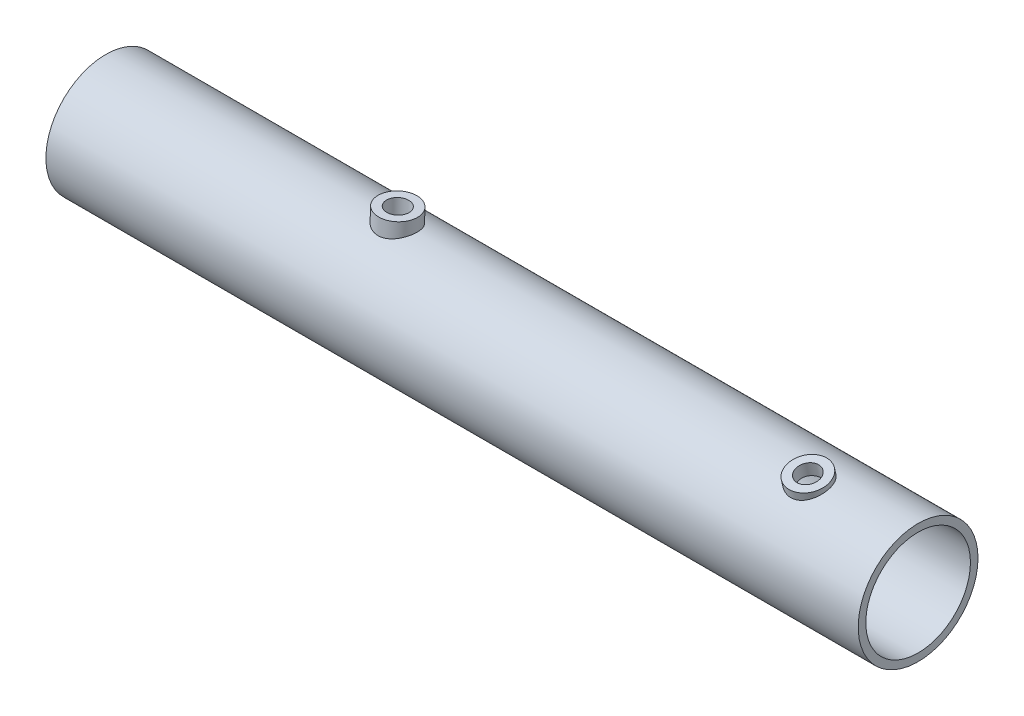
ISO-10303-21;
HEADER;
FILE_DESCRIPTION(('STEP AP214'),'2;1');
FILE_NAME('part.step','',(''),(''),'','','');
FILE_SCHEMA(('AUTOMOTIVE_DESIGN { 1 0 10303 214 1 1 1 1 }'));
ENDSEC;
DATA;
#1=APPLICATION_CONTEXT('core data for automotive mechanical design processes');
#2=APPLICATION_PROTOCOL_DEFINITION('international standard','automotive_design',2000,#1);
#3=PRODUCT_CONTEXT('',#1,'mechanical');
#4=PRODUCT('Part','Part','',(#3));
#5=PRODUCT_RELATED_PRODUCT_CATEGORY('part','',(#4));
#6=PRODUCT_DEFINITION_FORMATION('','',#4);
#7=PRODUCT_DEFINITION_CONTEXT('part definition',#1,'design');
#8=PRODUCT_DEFINITION('design','',#6,#7);
#9=PRODUCT_DEFINITION_SHAPE('','',#8);
#10=(LENGTH_UNIT() NAMED_UNIT(*) SI_UNIT(.MILLI.,.METRE.));
#11=(NAMED_UNIT(*) PLANE_ANGLE_UNIT() SI_UNIT($,.RADIAN.));
#12=(NAMED_UNIT(*) SI_UNIT($,.STERADIAN.) SOLID_ANGLE_UNIT());
#13=UNCERTAINTY_MEASURE_WITH_UNIT(LENGTH_MEASURE(1.E-05),#10,'distance_accuracy_value','');
#14=(GEOMETRIC_REPRESENTATION_CONTEXT(3) GLOBAL_UNCERTAINTY_ASSIGNED_CONTEXT((#13)) GLOBAL_UNIT_ASSIGNED_CONTEXT((#10,
#11,#12)) REPRESENTATION_CONTEXT('',''));
#15=CARTESIAN_POINT('',(0.,0.,0.));
#16=DIRECTION('',(0.,0.,1.));
#17=DIRECTION('',(1.,0.,0.));
#18=AXIS2_PLACEMENT_3D('',#15,#16,#17);
#19=CARTESIAN_POINT('',(295.,0.,0.));
#20=DIRECTION('',(-1.,0.,0.));
#21=DIRECTION('',(0.,0.,1.));
#22=AXIS2_PLACEMENT_3D('',#19,#20,#21);
#23=CYLINDRICAL_SURFACE('',#22,21.75);
#24=CARTESIAN_POINT('',(260.456376429784,18.3671321405636,11.6495045787826));
#25=CARTESIAN_POINT('',(260.646898102656,18.3671322417386,11.6495045007218));
#26=CARTESIAN_POINT('',(260.837421417738,18.3715626970911,11.6425279792126));
#27=CARTESIAN_POINT('',(261.217041275634,18.3891812990565,11.6146795241124));
#28=CARTESIAN_POINT('',(261.406137801234,18.4023695511696,11.5938074231295));
#29=CARTESIAN_POINT('',(261.781515058111,18.4372018067194,11.5383343317307));
#30=CARTESIAN_POINT('',(261.967795761762,18.458845893059,11.5037332067125));
#31=CARTESIAN_POINT('',(262.336289023577,18.5101185593613,11.4210496127633));
#32=CARTESIAN_POINT('',(262.518500030714,18.5397501290961,11.3729620955066));
#33=CARTESIAN_POINT('',(262.87711959476,18.6062822321463,11.263784134165));
#34=CARTESIAN_POINT('',(263.05354110399,18.6431650349375,11.2027253782472));
#35=CARTESIAN_POINT('',(263.399984059704,18.7235147451763,11.067910944351));
#36=CARTESIAN_POINT('',(263.570003093714,18.766984104073,10.994150537547));
#37=CARTESIAN_POINT('',(263.902523068557,18.8596627107682,10.8343961273323));
#38=CARTESIAN_POINT('',(264.065025642144,18.9088707037428,10.7484047974656));
#39=CARTESIAN_POINT('',(264.381639562437,19.0121510705117,10.5646453738589));
#40=CARTESIAN_POINT('',(264.53574763072,19.0662253232367,10.4668727262057));
#41=CARTESIAN_POINT('',(264.994705497099,19.2383436053802,10.1492809285233));
#42=CARTESIAN_POINT('',(265.284498725345,19.362951146295,9.91076902783006));
#43=CARTESIAN_POINT('',(265.817193347288,19.6207933919555,9.38994758260221));
#44=CARTESIAN_POINT('',(266.060086623045,19.7540295849195,9.1076304710237));
#45=CARTESIAN_POINT('',(266.387463593153,19.9559806708337,8.65160171178329));
#46=CARTESIAN_POINT('',(266.491618367903,20.0246286385753,8.49167365879143));
#47=CARTESIAN_POINT('',(266.68504944257,20.1609618094932,8.16270475630642));
#48=CARTESIAN_POINT('',(266.774331641192,20.2286473845811,7.99366755502538));
#49=CARTESIAN_POINT('',(266.937299999104,20.3620592692421,7.64744920143066));
#50=CARTESIAN_POINT('',(267.010982580518,20.4277851263774,7.47026619213941));
#51=CARTESIAN_POINT('',(267.14203678087,20.5562891341866,7.10902244017815));
#52=CARTESIAN_POINT('',(267.199415680647,20.6190685901636,6.92496480923295));
#53=CARTESIAN_POINT('',(267.295788115333,20.7389187532056,6.55713152126768));
#54=CARTESIAN_POINT('',(267.335306601108,20.7961073170407,6.37353172454558));
#55=CARTESIAN_POINT('',(267.398161180051,20.9062431420861,6.00241131812211));
#56=CARTESIAN_POINT('',(267.421503908972,20.9591921345945,5.81489234873673));
#57=CARTESIAN_POINT('',(267.451786011437,21.0603146866953,5.43726506663005));
#58=CARTESIAN_POINT('',(267.458725878233,21.1084883898441,5.24715683194374));
#59=CARTESIAN_POINT('',(267.456116137022,21.1996411705263,4.86581370608762));
#60=CARTESIAN_POINT('',(267.446566940301,21.2426203775968,4.67457884313778));
#61=CARTESIAN_POINT('',(267.411769610396,21.3215033189752,4.30013196804825));
#62=CARTESIAN_POINT('',(267.387164463296,21.3576212501996,4.11690490717022));
#63=CARTESIAN_POINT('',(267.323028891725,21.4247267490357,3.75206578003611));
#64=CARTESIAN_POINT('',(267.283493412799,21.4557125741284,3.5704542820415));
#65=CARTESIAN_POINT('',(267.189847446232,21.5125502700499,3.21028226877589));
#66=CARTESIAN_POINT('',(267.135741910704,21.5384038800534,3.03172073876127));
#67=CARTESIAN_POINT('',(267.013368442857,21.5851417264709,2.67877961845415));
#68=CARTESIAN_POINT('',(266.945095179497,21.6060240859303,2.50440162998132));
#69=CARTESIAN_POINT('',(266.794284097981,21.6432170238968,2.15962513541687));
#70=CARTESIAN_POINT('',(266.711628980722,21.6594868636175,1.98927357589332));
#71=CARTESIAN_POINT('',(266.533048124578,21.6875735747036,1.65522246113258));
#72=CARTESIAN_POINT('',(266.437117848047,21.6993889182906,1.49152520529413));
#73=CARTESIAN_POINT('',(266.232672789605,21.7189942911377,1.17193110052309));
#74=CARTESIAN_POINT('',(266.124157613075,21.7267841941323,1.01603449641129));
#75=CARTESIAN_POINT('',(265.895252211212,21.7388366271445,0.713071232884585));
#76=CARTESIAN_POINT('',(265.774861579487,21.7430990363998,0.566004875929366));
#77=CARTESIAN_POINT('',(265.517550594194,21.7487595813445,0.275583625796235));
#78=CARTESIAN_POINT('',(265.38014314423,21.7500272346696,0.132657406400566));
#79=CARTESIAN_POINT('',(265.094152514793,21.7499718786044,-0.141440651379987));
#80=CARTESIAN_POINT('',(264.945572863981,21.7486496839217,-0.272616172694221));
#81=CARTESIAN_POINT('',(264.63804922655,21.7440859989185,-0.522332149482237));
#82=CARTESIAN_POINT('',(264.479100038002,21.7408435385961,-0.640866183505778));
#83=CARTESIAN_POINT('',(264.151960690521,21.7331107033341,-0.86422602997955));
#84=CARTESIAN_POINT('',(263.983774114504,21.7286208095335,-0.969057104825561));
#85=CARTESIAN_POINT('',(263.636559678825,21.7189690382993,-1.16564165015239));
#86=CARTESIAN_POINT('',(263.457406259212,21.7137980185756,-1.25717316823259));
#87=CARTESIAN_POINT('',(263.091902280473,21.7034743779061,-1.42432970358908));
#88=CARTESIAN_POINT('',(262.905554493169,21.6983217506936,-1.49996077595809));
#89=CARTESIAN_POINT('',(262.526936811136,21.6885964805492,-1.63457689243846));
#90=CARTESIAN_POINT('',(262.33466741732,21.6840237887267,-1.69356334026665));
#91=CARTESIAN_POINT('',(261.945632380696,21.6759253047353,-1.79424608899837));
#92=CARTESIAN_POINT('',(261.748866931621,21.672399467549,-1.83594313342366));
#93=CARTESIAN_POINT('',(261.359916055582,21.6668479495967,-1.90031635775887));
#94=CARTESIAN_POINT('',(261.167840904155,21.6647703319852,-1.92365540572365));
#95=CARTESIAN_POINT('',(260.782382824914,21.6620884268045,-1.95362587281871));
#96=CARTESIAN_POINT('',(260.588999936067,21.6614840955276,-1.96025778759665));
#97=CARTESIAN_POINT('',(260.202416564243,21.661802278276,-1.95673822639168));
#98=CARTESIAN_POINT('',(260.009216059463,21.6627245778844,-1.94658910732283));
#99=CARTESIAN_POINT('',(259.624430933613,21.6660142259454,-1.90962583390135));
#100=CARTESIAN_POINT('',(259.432846295204,21.6683815588713,-1.88281185861212));
#101=CARTESIAN_POINT('',(259.058366599581,21.6742606601696,-1.81385784924365));
#102=CARTESIAN_POINT('',(258.875382478462,21.6777363402197,-1.77219678822769));
#103=CARTESIAN_POINT('',(258.513448113292,21.6855503902809,-1.67386820421271));
#104=CARTESIAN_POINT('',(258.334499235252,21.6898890476872,-1.61719567988977));
#105=CARTESIAN_POINT('',(257.981901391771,21.6990384528948,-1.48940541318085));
#106=CARTESIAN_POINT('',(257.808251195607,21.7038490899584,-1.41829105502331));
#107=CARTESIAN_POINT('',(257.467216553194,21.7134848220033,-1.26221560946074));
#108=CARTESIAN_POINT('',(257.299834509451,21.718309921778,-1.17724927822896));
#109=CARTESIAN_POINT('',(256.967952963388,21.7275829672978,-0.991712928215651));
#110=CARTESIAN_POINT('',(256.803654664059,21.7320171400696,-0.890782303319407));
#111=CARTESIAN_POINT('',(256.483723014876,21.7397621932911,-0.675870687250705));
#112=CARTESIAN_POINT('',(256.328092685981,21.7430726841378,-0.561885187976744));
#113=CARTESIAN_POINT('',(256.02646817283,21.7479513714782,-0.321758746412558));
#114=CARTESIAN_POINT('',(255.880474549265,21.749519466678,-0.195617097890059));
#115=CARTESIAN_POINT('',(255.598996651283,21.7502930429308,0.0679001002227277));
#116=CARTESIAN_POINT('',(255.463512561331,21.7494984825238,0.205275846909043));
#117=CARTESIAN_POINT('',(255.198626761549,21.7448477613791,0.496063898453863));
#118=CARTESIAN_POINT('',(255.069691676239,21.7408692502668,0.649899792805963));
#119=CARTESIAN_POINT('',(254.825008735324,21.7290514936775,0.967502606920927));
#120=CARTESIAN_POINT('',(254.709256399508,21.7212135646891,1.13126612357422));
#121=CARTESIAN_POINT('',(254.491684043367,21.7010818941056,1.46762923940858));
#122=CARTESIAN_POINT('',(254.389868952296,21.6887865816263,1.64023193528069));
#123=CARTESIAN_POINT('',(254.201046239746,21.6592310334569,1.99286162996713));
#124=CARTESIAN_POINT('',(254.114032434179,21.6419728794282,2.17288548891338));
#125=CARTESIAN_POINT('',(253.956179995472,21.6022505309158,2.53743767877672));
#126=CARTESIAN_POINT('',(253.885205453408,21.5798336011232,2.72191226898782));
#127=CARTESIAN_POINT('',(253.759099234069,21.5294355878397,3.09538177586982));
#128=CARTESIAN_POINT('',(253.703961194915,21.5014567463579,3.28437484422227));
#129=CARTESIAN_POINT('',(253.609995179789,21.4397817441468,3.66544795491474));
#130=CARTESIAN_POINT('',(253.571166130149,21.4060859599852,3.85752779317921));
#131=CARTESIAN_POINT('',(253.510178665868,21.3329779941875,4.24323836328338));
#132=CARTESIAN_POINT('',(253.488019639087,21.2935660225189,4.43686903791088));
#133=CARTESIAN_POINT('',(253.461158887721,21.210983093471,4.81588053796673));
#134=CARTESIAN_POINT('',(253.455755371941,21.1680430263552,5.00126229950579));
#135=CARTESIAN_POINT('',(253.460452128356,21.0773370970595,5.37071235486291));
#136=CARTESIAN_POINT('',(253.470557689396,21.0295695938361,5.55478017909983));
#137=CARTESIAN_POINT('',(253.506165115584,20.9296539671317,5.92012976261077));
#138=CARTESIAN_POINT('',(253.531660385611,20.8775077283544,6.10141268122528));
#139=CARTESIAN_POINT('',(253.597804173579,20.7693274223144,6.46008093792177));
#140=CARTESIAN_POINT('',(253.638458367481,20.7132919051919,6.63746478969666));
#141=CARTESIAN_POINT('',(253.734039290517,20.5985974050972,6.98522972404015));
#142=CARTESIAN_POINT('',(253.788808405395,20.5399729702303,7.15566547910765));
#143=CARTESIAN_POINT('',(253.91235670334,20.4202461910246,7.49050966368584));
#144=CARTESIAN_POINT('',(253.98114098628,20.3591429511929,7.65491587338092));
#145=CARTESIAN_POINT('',(254.207707505405,20.1732813115385,8.13754642833287));
#146=CARTESIAN_POINT('',(254.385784312584,20.0458734058893,8.44547440777313));
#147=CARTESIAN_POINT('',(254.798741192857,19.7859987242758,9.03800706064655));
#148=CARTESIAN_POINT('',(255.035519017485,19.6535233013893,9.32128471653404));
#149=CARTESIAN_POINT('',(255.425474688215,19.4607108342185,9.71414740362359));
#150=CARTESIAN_POINT('',(255.561359474926,19.3973835289661,9.83983183116818));
#151=CARTESIAN_POINT('',(255.843958969838,19.2736966802644,10.0799461665451));
#152=CARTESIAN_POINT('',(255.990669815965,19.2133360911528,10.1943800542272));
#153=CARTESIAN_POINT('',(256.299516921875,19.0944971458704,10.4153247817997));
#154=CARTESIAN_POINT('',(256.462017809931,19.0361640768606,10.5214039041228));
#155=CARTESIAN_POINT('',(256.796645788223,18.9248963196898,10.7202507765377));
#156=CARTESIAN_POINT('',(256.96876941245,18.8719597069329,10.8130232771507));
#157=CARTESIAN_POINT('',(257.32155669818,18.7725399026555,10.9847208525162));
#158=CARTESIAN_POINT('',(257.502219461569,18.7260560344746,11.0636473794417));
#159=CARTESIAN_POINT('',(257.870859530844,18.6405407379539,11.2071282165658));
#160=CARTESIAN_POINT('',(258.058836102085,18.6015085634325,11.2716839659019));
#161=CARTESIAN_POINT('',(258.426716390816,18.5343466240096,11.3817547083484));
#162=CARTESIAN_POINT('',(258.606198790358,18.5056266112277,11.4283200482353));
#163=CARTESIAN_POINT('',(258.969100414851,18.4559386328033,11.5083905860708));
#164=CARTESIAN_POINT('',(259.152519324634,18.434970048991,11.5418968254829));
#165=CARTESIAN_POINT('',(259.522029998594,18.4012348994778,11.5956053083698));
#166=CARTESIAN_POINT('',(259.708121579366,18.3884677736935,11.6158084603244));
#167=CARTESIAN_POINT('',(260.081600694967,18.3714177848928,11.6427558489349));
#168=CARTESIAN_POINT('',(260.268987768054,18.3671320410523,11.6495046555597));
#169=CARTESIAN_POINT('',(260.456376429784,18.3671321405636,11.6495045787826));
#170=B_SPLINE_CURVE_WITH_KNOTS('',3,(#24,#25,#26,#27,#28,#29,#30,#31,#32,#33,#34,#35,#36,#37,
#38,#39,#40,#41,#42,#43,#44,#45,#46,#47,#48,#49,#50,#51,#52,#53,#54,#55,#56,#57,#58,#59,#60,#61,
#62,#63,#64,#65,#66,#67,#68,#69,#70,#71,#72,#73,#74,#75,#76,#77,#78,#79,#80,#81,#82,#83,#84,#85,
#86,#87,#88,#89,#90,#91,#92,#93,#94,#95,#96,#97,#98,#99,#100,#101,#102,#103,#104,#105,#106,#107,
#108,#109,#110,#111,#112,#113,#114,#115,#116,#117,#118,#119,#120,#121,#122,#123,#124,#125,#126,
#127,#128,#129,#130,#131,#132,#133,#134,#135,#136,#137,#138,#139,#140,#141,#142,#143,#144,#145,
#146,#147,#148,#149,#150,#151,#152,#153,#154,#155,#156,#157,#158,#159,#160,#161,#162,#163,#164,
#165,#166,#167,#168,#169),.UNSPECIFIED.,.T.,.F.,(4,2,2,2,2,2,2,2,2,2,2,2,2,2,2,2,2,2,2,2,2,2,2,
2,2,2,2,2,2,2,2,2,2,2,2,2,2,2,2,2,2,2,2,2,2,2,2,2,2,2,2,2,2,2,2,2,2,2,2,2,2,2,2,2,2,2,2,2,2,2,2,
2,4),(0.,0.571389678197333,1.1427862397185,1.71418840347069,2.28580474483246,2.85604038907651,
3.42648879290671,3.99681269413055,4.56735775800894,5.74810516762801,6.92905677064886,
7.53689538761278,8.14449234886982,8.75222851591014,9.35969285427679,9.94790904642436,
10.535883792609,11.1238408575162,11.7117832572702,12.2762168926292,12.840841780654,
13.4052750040702,13.9699209991468,14.5394088647516,15.1090918728322,15.6787927490201,
16.2485131278747,16.8426322534677,17.4365645126335,18.0307970466621,18.6248007007869,
19.2277949434523,19.8305591406023,20.4332724887052,21.0359599147464,21.6157343544472,
22.1954915938768,22.7751674127015,23.3548370030337,23.9172857203349,24.4799220631915,
25.0424267124329,25.6051448009862,26.18312003595,26.7612954621922,27.3395044987976,
27.9177236819375,28.519294928171,29.1206611140338,29.722239441505,30.3235658043978,
30.9195879383065,31.5153703008351,32.1111134351518,32.706834692109,33.2772423630863,
33.8478445954706,34.4182024748613,34.9887741283678,35.5532314856047,36.1178946069373,
37.2462781005066,38.4174455448929,39.003805403815,39.5899570874067,40.197144229145,
40.8041140600217,41.4110201934745,42.01786552196,42.5801332857373,43.1423561994731,
43.7045407145157,44.2665342426498),.UNSPECIFIED.);
#171=CARTESIAN_POINT('',(260.456376429784,18.3671321405636,11.6495045787826));
#172=VERTEX_POINT('',#171);
#173=EDGE_CURVE('E43',#172,#172,#170,.T.);
#174=ORIENTED_EDGE('',*,*,#173,.F.);
#175=EDGE_LOOP('',(#174));
#176=FACE_BOUND('',#175,.T.);
#177=CARTESIAN_POINT('',(295.,0.,0.));
#178=DIRECTION('',(1.,0.,0.));
#179=DIRECTION('',(0.,0.,-1.));
#180=AXIS2_PLACEMENT_3D('',#177,#178,#179);
#181=CIRCLE('',#180,21.75);
#182=CARTESIAN_POINT('',(295.,0.,-21.75));
#183=VERTEX_POINT('',#182);
#184=EDGE_CURVE('E47',#183,#183,#181,.T.);
#185=ORIENTED_EDGE('',*,*,#184,.F.);
#186=EDGE_LOOP('',(#185));
#187=FACE_BOUND('',#186,.T.);
#188=CARTESIAN_POINT('',(0.,0.,0.));
#189=DIRECTION('',(1.,0.,0.));
#190=DIRECTION('',(0.,0.,-1.));
#191=AXIS2_PLACEMENT_3D('',#188,#189,#190);
#192=CIRCLE('',#191,21.75);
#193=CARTESIAN_POINT('',(0.,0.,-21.75));
#194=VERTEX_POINT('',#193);
#195=EDGE_CURVE('E51',#194,#194,#192,.T.);
#196=ORIENTED_EDGE('',*,*,#195,.T.);
#197=EDGE_LOOP('',(#196));
#198=FACE_BOUND('',#197,.T.);
#199=CARTESIAN_POINT('',(105.42644355876,20.7342913544785,6.56899246670265));
#200=CARTESIAN_POINT('',(105.61761622317,20.7342914649437,6.56899231964091));
#201=CARTESIAN_POINT('',(105.808791134861,20.7368002374002,6.5610892040586));
#202=CARTESIAN_POINT('',(106.189710828106,20.7467478425617,6.52956542817701));
#203=CARTESIAN_POINT('',(106.379455584877,20.7541867605066,6.50594449612399));
#204=CARTESIAN_POINT('',(106.756125793255,20.7737436123354,6.44322532082809));
#205=CARTESIAN_POINT('',(106.943051183493,20.7858616479181,6.40412674118373));
#206=CARTESIAN_POINT('',(107.312822300558,20.8143823689515,6.31081320129046));
#207=CARTESIAN_POINT('',(107.495666471318,20.8307866593475,6.25659257822988));
#208=CARTESIAN_POINT('',(107.855551616769,20.8673123397854,6.13366730177155));
#209=CARTESIAN_POINT('',(108.032605355263,20.8874247995185,6.06499739133372));
#210=CARTESIAN_POINT('',(108.38026160528,20.9307725160008,5.91366585936169));
#211=CARTESIAN_POINT('',(108.55086165464,20.9540089494915,5.83099896237015));
#212=CARTESIAN_POINT('',(109.051280539083,21.0273704998056,5.56296613661674));
#213=CARTESIAN_POINT('',(109.370023813059,21.0811807512872,5.35746292344752));
#214=CARTESIAN_POINT('',(109.980467860493,21.1944809222411,4.89038937479742));
#215=CARTESIAN_POINT('',(110.270842971192,21.2541032716554,4.62711798723189));
#216=CARTESIAN_POINT('',(110.670854487131,21.3413342741562,4.19896183071144));
#217=CARTESIAN_POINT('',(110.798332075107,21.3700607142372,4.05060286810402));
#218=CARTESIAN_POINT('',(111.040652577443,21.4259609794756,3.74365958716139));
#219=CARTESIAN_POINT('',(111.155500230249,21.453135385067,3.5850791393415));
#220=CARTESIAN_POINT('',(111.374472347296,21.5057862315671,3.25458976198307));
#221=CARTESIAN_POINT('',(111.478258241249,21.5312034786493,3.08244715714844));
#222=CARTESIAN_POINT('',(111.670893931814,21.5787676958475,2.72964242799672));
#223=CARTESIAN_POINT('',(111.759749276262,21.6009158802954,2.54898350023683));
#224=CARTESIAN_POINT('',(111.921813560263,21.6412329261512,2.18034696452618));
#225=CARTESIAN_POINT('',(111.995022621971,21.6594018186264,1.99236941372741));
#226=CARTESIAN_POINT('',(112.125122170156,21.6911406541621,1.61047214758083));
#227=CARTESIAN_POINT('',(112.182013342325,21.7047107904705,1.41655268229644));
#228=CARTESIAN_POINT('',(112.277249342859,21.7263771701451,1.03102658883643));
#229=CARTESIAN_POINT('',(112.316166172426,21.7346460697053,0.839570879810655));
#230=CARTESIAN_POINT('',(112.377893408564,21.7461180558689,0.453932524506414));
#231=CARTESIAN_POINT('',(112.400704452038,21.7493213427983,0.259749986370263));
#232=CARTESIAN_POINT('',(112.429987419854,21.7504846090225,-0.12981862036816));
#233=CARTESIAN_POINT('',(112.436462774807,21.7484456894003,-0.325204427633797));
#234=CARTESIAN_POINT('',(112.433013264391,21.7390986424883,-0.715702860345628));
#235=CARTESIAN_POINT('',(112.423088775319,21.7317906361009,-0.91081549195708));
#236=CARTESIAN_POINT('',(112.387641006381,21.7124154554608,-1.29168620927507));
#237=CARTESIAN_POINT('',(112.362740370034,21.7005447423969,-1.47751264363137));
#238=CARTESIAN_POINT('',(112.298093687158,21.6722855485276,-1.84627925093861));
#239=CARTESIAN_POINT('',(112.258342707113,21.6558955668253,-2.02921844362899));
#240=CARTESIAN_POINT('',(112.164357743637,21.6189595563349,-2.39083971057021));
#241=CARTESIAN_POINT('',(112.110128479066,21.5984148822003,-2.56952315125356));
#242=CARTESIAN_POINT('',(111.987609389843,21.5536143256011,-2.92159470004741));
#243=CARTESIAN_POINT('',(111.919314264004,21.5293570448051,-3.09498078329797));
#244=CARTESIAN_POINT('',(111.768331561509,21.4773781157194,-3.43730327074111));
#245=CARTESIAN_POINT('',(111.685484722792,21.4496192052589,-3.60616373298758));
#246=CARTESIAN_POINT('',(111.506552166455,21.3914936908516,-3.93631900349587));
#247=CARTESIAN_POINT('',(111.410461917622,21.361126195727,-4.09761119685805));
#248=CARTESIAN_POINT('',(111.20573146209,21.2984875484485,-4.41163995761499));
#249=CARTESIAN_POINT('',(111.09709069557,21.266216311409,-4.56437614291383));
#250=CARTESIAN_POINT('',(110.86797011288,21.2005120974818,-4.86043039343062));
#251=CARTESIAN_POINT('',(110.747489875026,21.1670790792428,-5.0037481228904));
#252=CARTESIAN_POINT('',(110.489687464432,21.0982910648142,-5.28646706846969));
#253=CARTESIAN_POINT('',(110.351848182984,21.0629178762801,-5.4253927302117));
#254=CARTESIAN_POINT('',(110.064967123188,20.9926606492623,-5.69118564994214));
#255=CARTESIAN_POINT('',(109.915928866655,20.9577764610602,-5.81805667064707));
#256=CARTESIAN_POINT('',(109.607457193639,20.8893762413824,-6.05905622384778));
#257=CARTESIAN_POINT('',(109.448018444608,20.8558609263053,-6.17317813697307));
#258=CARTESIAN_POINT('',(109.119868680845,20.7911292261005,-6.38780157186658));
#259=CARTESIAN_POINT('',(108.951161283128,20.7599119551523,-6.48830835450457));
#260=CARTESIAN_POINT('',(108.602836842412,20.7001746271314,-6.67646369097894));
#261=CARTESIAN_POINT('',(108.423092446402,20.6717030994427,-6.76389218538646));
#262=CARTESIAN_POINT('',(108.056370822652,20.6188655850897,-6.92328932541984));
#263=CARTESIAN_POINT('',(107.869396407719,20.5944980211677,-6.9952639133115));
#264=CARTESIAN_POINT('',(107.489498198454,20.5506121270152,-7.12316060547992));
#265=CARTESIAN_POINT('',(107.296575028947,20.5310932894377,-7.1790843893296));
#266=CARTESIAN_POINT('',(106.906212801523,20.4975312417467,-7.27435703760065));
#267=CARTESIAN_POINT('',(106.708773955138,20.4834877756987,-7.31370667675197));
#268=CARTESIAN_POINT('',(106.319096906722,20.4617970958955,-7.37416753054218));
#269=CARTESIAN_POINT('',(106.126977600706,20.4539111342226,-7.39596068480141));
#270=CARTESIAN_POINT('',(105.741452148633,20.4438510847573,-7.42372370783662));
#271=CARTESIAN_POINT('',(105.548046045382,20.4416768079023,-7.42969410036197));
#272=CARTESIAN_POINT('',(105.161448553451,20.4431116069971,-7.42574518190556));
#273=CARTESIAN_POINT('',(104.968257136233,20.4467197901995,-7.41582832373815));
#274=CARTESIAN_POINT('',(104.583530174342,20.4596078878987,-7.38019667947714));
#275=CARTESIAN_POINT('',(104.391994609024,20.4688877315786,-7.35448209063526));
#276=CARTESIAN_POINT('',(104.018234863805,20.4924409703972,-7.28858974401313));
#277=CARTESIAN_POINT('',(103.835911097352,20.5065409993146,-7.24891287286247));
#278=CARTESIAN_POINT('',(103.475322039694,20.5393864141895,-7.15531715755702));
#279=CARTESIAN_POINT('',(103.297058118775,20.5581333439308,-7.10139357999758));
#280=CARTESIAN_POINT('',(102.94584878327,20.5997491252352,-6.97975376873141));
#281=CARTESIAN_POINT('',(102.772902118335,20.6226169989473,-6.91204080658731));
#282=CARTESIAN_POINT('',(102.433284367832,20.6718776992514,-6.76329127792212));
#283=CARTESIAN_POINT('',(102.266615690223,20.698271861073,-6.68224966180502));
#284=CARTESIAN_POINT('',(101.936170598964,20.7546563060406,-6.50504545079798));
#285=CARTESIAN_POINT('',(101.772595728979,20.784724797745,-6.40853191223721));
#286=CARTESIAN_POINT('',(101.454096050278,20.8470820437405,-6.20267973115886));
#287=CARTESIAN_POINT('',(101.299174253839,20.8793715625864,-6.09333666303713));
#288=CARTESIAN_POINT('',(100.998934067094,20.9453464417816,-5.86253904155953));
#289=CARTESIAN_POINT('',(100.853616282319,20.9790318899265,-5.74108372573761));
#290=CARTESIAN_POINT('',(100.573439200551,21.0469677804168,-5.48679905378874));
#291=CARTESIAN_POINT('',(100.438580118835,21.0812182343744,-5.35396946365689));
#292=CARTESIAN_POINT('',(100.174550785555,21.1509296486664,-5.07175459709356));
#293=CARTESIAN_POINT('',(100.045875751006,21.1863792068337,-4.92190265995209));
#294=CARTESIAN_POINT('',(99.8016838937065,21.2560671744943,-4.61165623351523));
#295=CARTESIAN_POINT('',(99.6861626607064,21.2903059872601,-4.45126530638162));
#296=CARTESIAN_POINT('',(99.4690073021004,21.3567209908802,-4.12084586539018));
#297=CARTESIAN_POINT('',(99.3673783251355,21.3888964146846,-3.95081381126397));
#298=CARTESIAN_POINT('',(99.1788713398998,21.4503353822881,-3.6023457300248));
#299=CARTESIAN_POINT('',(99.0919872255905,21.4796001293477,-3.42391322094522));
#300=CARTESIAN_POINT('',(98.9340991004518,21.5343225574666,-3.06087330904641));
#301=CARTESIAN_POINT('',(98.8630038187707,21.559801821941,-2.8763088856536));
#302=CARTESIAN_POINT('',(98.7366792300995,21.6065094875409,-2.50138280720846));
#303=CARTESIAN_POINT('',(98.681443586356,21.6277395854003,-2.31102350123292));
#304=CARTESIAN_POINT('',(98.5873087387711,21.6654338588504,-1.9258542597688));
#305=CARTESIAN_POINT('',(98.5484085256023,21.6818983288783,-1.73104460004143));
#306=CARTESIAN_POINT('',(98.4873125639382,21.7096691499526,-1.33846215685381));
#307=CARTESIAN_POINT('',(98.4651161934391,21.7209756930596,-1.14068948400752));
#308=CARTESIAN_POINT('',(98.4382183927656,21.7378266158282,-0.752078543455645));
#309=CARTESIAN_POINT('',(98.4328216711763,21.7435929564113,-0.561297690258433));
#310=CARTESIAN_POINT('',(98.4375999987409,21.7500940169573,-0.179778193360682));
#311=CARTESIAN_POINT('',(98.4477803690577,21.7508270170525,0.0109604136452912));
#312=CARTESIAN_POINT('',(98.4836165209002,21.7473172172215,0.390845739138539));
#313=CARTESIAN_POINT('',(98.5092655362014,21.7430765920699,0.579993116996348));
#314=CARTESIAN_POINT('',(98.5758063475601,21.7298150424645,0.955484965826434));
#315=CARTESIAN_POINT('',(98.6167038421637,21.7207923303532,1.14182836179638));
#316=CARTESIAN_POINT('',(98.7127654620478,21.6984259100945,1.50798169630958));
#317=CARTESIAN_POINT('',(98.7677402217285,21.6851390044587,1.68784473859988));
#318=CARTESIAN_POINT('',(98.8917427198156,21.6546314083193,2.04234300729451));
#319=CARTESIAN_POINT('',(98.9607755726684,21.6374092858735,2.21697630447769));
#320=CARTESIAN_POINT('',(99.1881611359994,21.5805802945052,2.73122282440074));
#321=CARTESIAN_POINT('',(99.3668835793201,21.5357903354245,3.06149568396676));
#322=CARTESIAN_POINT('',(99.7807696430164,21.4355696440862,3.69959599747352));
#323=CARTESIAN_POINT('',(100.017688666384,21.3798215409583,4.00623442188274));
#324=CARTESIAN_POINT('',(100.407795768882,21.2938186369588,4.43362718657612));
#325=CARTESIAN_POINT('',(100.543719910153,21.2647343961821,4.5707430114169));
#326=CARTESIAN_POINT('',(100.826372903824,21.2065933228847,4.83331578286636));
#327=CARTESIAN_POINT('',(100.973097896373,21.177536484295,4.95877685857135));
#328=CARTESIAN_POINT('',(101.28167253397,21.1193031513153,5.20131051668615));
#329=CARTESIAN_POINT('',(101.443867420581,21.0901564021895,5.31795081883164));
#330=CARTESIAN_POINT('',(101.777808252155,21.0337021672598,5.53702680546858));
#331=CARTESIAN_POINT('',(101.949550766289,21.0063940284727,5.63946754677071));
#332=CARTESIAN_POINT('',(102.30149712122,20.954488320306,5.8293751372452));
#333=CARTESIAN_POINT('',(102.481700080953,20.9298904695678,5.91684354123797));
#334=CARTESIAN_POINT('',(102.84934129993,20.884223144804,6.0760669747898));
#335=CARTESIAN_POINT('',(103.036778847188,20.8631533246547,6.14782354599932));
#336=CARTESIAN_POINT('',(103.403568105123,20.8266554992512,6.27030288371707));
#337=CARTESIAN_POINT('',(103.582504368926,20.8109270157266,6.32218246071974));
#338=CARTESIAN_POINT('',(103.944259143557,20.7835995491138,6.41144859475932));
#339=CARTESIAN_POINT('',(104.127077358188,20.7720002521569,6.44883625337846));
#340=CARTESIAN_POINT('',(104.495349549747,20.7532928726578,6.50878817774275));
#341=CARTESIAN_POINT('',(104.680803409023,20.7461845902813,6.53135310304901));
#342=CARTESIAN_POINT('',(105.052985612492,20.7366845589717,6.56145282821879));
#343=CARTESIAN_POINT('',(105.239713513603,20.7342912465805,6.56899261034686));
#344=CARTESIAN_POINT('',(105.42644355876,20.7342913544785,6.56899246670265));
#345=B_SPLINE_CURVE_WITH_KNOTS('',3,(#199,#200,#201,#202,#203,#204,#205,#206,#207,#208,#209,
#210,#211,#212,#213,#214,#215,#216,#217,#218,#219,#220,#221,#222,#223,#224,#225,#226,#227,#228,
#229,#230,#231,#232,#233,#234,#235,#236,#237,#238,#239,#240,#241,#242,#243,#244,#245,#246,#247,
#248,#249,#250,#251,#252,#253,#254,#255,#256,#257,#258,#259,#260,#261,#262,#263,#264,#265,#266,
#267,#268,#269,#270,#271,#272,#273,#274,#275,#276,#277,#278,#279,#280,#281,#282,#283,#284,#285,
#286,#287,#288,#289,#290,#291,#292,#293,#294,#295,#296,#297,#298,#299,#300,#301,#302,#303,#304,
#305,#306,#307,#308,#309,#310,#311,#312,#313,#314,#315,#316,#317,#318,#319,#320,#321,#322,#323,
#324,#325,#326,#327,#328,#329,#330,#331,#332,#333,#334,#335,#336,#337,#338,#339,#340,#341,#342,
#343,#344),.UNSPECIFIED.,.T.,.F.,(4,2,2,2,2,2,2,2,2,2,2,2,2,2,2,2,2,2,2,2,2,2,2,2,2,2,2,2,2,2,2,
2,2,2,2,2,2,2,2,2,2,2,2,2,2,2,2,2,2,2,2,2,2,2,2,2,2,2,2,2,2,2,2,2,2,2,2,2,2,2,2,2,4),(0.,
0.573343248068709,1.14669640923369,1.72006203272171,2.2936426556699,2.8658595636313,
3.43829262190539,4.58219561381935,5.76587326135187,6.35842153759872,6.95074674013156,
7.55783366995935,8.1646945195549,8.77155063105249,9.37838123820382,9.96428170686714,
10.5501590047768,11.1359132539621,11.7216540630915,12.2845797614207,12.8476926389703,
13.4106222065499,13.9737643223759,14.5435048545864,15.1134408088428,15.6834021951562,
16.2533838889921,16.8493215725768,17.44507262579,18.041131570903,18.6369595385831,
19.2418962282428,19.8465998921785,20.4512402562012,21.0558523542108,21.6356628313744,
22.2154541159866,22.795155895915,23.3748504377874,23.9355730032642,24.4964821011021,
25.057258276705,25.6182473953207,26.1944750457516,26.7709020561527,27.3473653755694,
27.923840557515,28.525145596338,29.126248430199,29.7275734396496,30.3286488217558,
30.9261534670788,31.5234190448289,32.12064771353,32.7178541420244,33.2899909550307,
33.8623232546516,34.434405388669,35.0067015315277,35.5716703373929,36.1368450517847,
37.2662329888077,38.4351211446499,39.0203316801368,39.6053340875412,40.2102969945398,
40.815043902882,41.4197279724029,42.0243526834996,42.5846254536448,43.1448556271098,
43.7050608705524,44.2650803217241),.UNSPECIFIED.);
#346=CARTESIAN_POINT('',(105.42644355876,20.7342913544785,6.56899246670265));
#347=VERTEX_POINT('',#346);
#348=EDGE_CURVE('E10',#347,#347,#345,.T.);
#349=ORIENTED_EDGE('',*,*,#348,.F.);
#350=EDGE_LOOP('',(#349));
#351=FACE_BOUND('',#350,.T.);
#352=ADVANCED_FACE('F32',(#176,#187,#198,#351),#23,.T.);
#353=CARTESIAN_POINT('',(295.,0.,0.));
#354=DIRECTION('',(1.,0.,0.));
#355=DIRECTION('',(0.,0.,-1.));
#356=AXIS2_PLACEMENT_3D('',#353,#354,#355);
#357=PLANE('',#356);
#358=ORIENTED_EDGE('',*,*,#184,.T.);
#359=EDGE_LOOP('',(#358));
#360=FACE_BOUND('',#359,.T.);
#361=CARTESIAN_POINT('',(295.,0.,0.));
#362=DIRECTION('',(1.,0.,0.));
#363=DIRECTION('',(0.,0.,-1.));
#364=AXIS2_PLACEMENT_3D('',#361,#362,#363);
#365=CIRCLE('',#364,19.);
#366=CARTESIAN_POINT('',(295.,0.,-19.));
#367=VERTEX_POINT('',#366);
#368=EDGE_CURVE('E122',#367,#367,#365,.T.);
#369=ORIENTED_EDGE('',*,*,#368,.F.);
#370=EDGE_LOOP('',(#369));
#371=FACE_BOUND('',#370,.T.);
#372=ADVANCED_FACE('F77',(#360,#371),#357,.T.);
#373=CARTESIAN_POINT('',(0.,0.,0.));
#374=DIRECTION('',(1.,0.,0.));
#375=DIRECTION('',(0.,0.,-1.));
#376=AXIS2_PLACEMENT_3D('',#373,#374,#375);
#377=PLANE('',#376);
#378=ORIENTED_EDGE('',*,*,#195,.F.);
#379=EDGE_LOOP('',(#378));
#380=FACE_BOUND('',#379,.T.);
#381=CARTESIAN_POINT('',(0.,0.,0.));
#382=DIRECTION('',(1.,0.,0.));
#383=DIRECTION('',(0.,0.,-1.));
#384=AXIS2_PLACEMENT_3D('',#381,#382,#383);
#385=CIRCLE('',#384,19.);
#386=CARTESIAN_POINT('',(0.,0.,-19.));
#387=VERTEX_POINT('',#386);
#388=EDGE_CURVE('E124',#387,#387,#385,.T.);
#389=ORIENTED_EDGE('',*,*,#388,.T.);
#390=EDGE_LOOP('',(#389));
#391=FACE_BOUND('',#390,.T.);
#392=ADVANCED_FACE('F75',(#380,#391),#377,.F.);
#393=CARTESIAN_POINT('',(295.,0.,0.));
#394=DIRECTION('',(-1.,0.,0.));
#395=DIRECTION('',(0.,0.,1.));
#396=AXIS2_PLACEMENT_3D('',#393,#394,#395);
#397=CYLINDRICAL_SURFACE('',#396,19.);
#398=CARTESIAN_POINT('',(105.41224964478,18.6518921163836,3.62034811569111));
#399=CARTESIAN_POINT('',(105.19060275322,18.6518963751163,3.62034017610146));
#400=CARTESIAN_POINT('',(104.968860254863,18.6555283946794,3.60176637563214));
#401=CARTESIAN_POINT('',(104.531666922402,18.6696128162529,3.52801857953967));
#402=CARTESIAN_POINT('',(104.316220870493,18.6800702684403,3.47281748266581));
#403=CARTESIAN_POINT('',(103.898007768727,18.7064769087578,3.32763031501209));
#404=CARTESIAN_POINT('',(103.695227830519,18.7224204033725,3.23768029547191));
#405=CARTESIAN_POINT('',(103.307580462627,18.7578435186748,3.02569070943351));
#406=CARTESIAN_POINT('',(103.122712467595,18.7773230277005,2.90365215618652));
#407=CARTESIAN_POINT('',(102.773225292337,18.8177575580084,2.6289709130444));
#408=CARTESIAN_POINT('',(102.608926821479,18.8387294547212,2.47592262471257));
#409=CARTESIAN_POINT('',(102.308015577708,18.8793254647274,2.14450301639505));
#410=CARTESIAN_POINT('',(102.171405032105,18.8989494695079,1.96612966113667));
#411=CARTESIAN_POINT('',(101.928272615483,18.9345946562956,1.58674833433694));
#412=CARTESIAN_POINT('',(101.822102579732,18.9505733048236,1.38551052152845));
#413=CARTESIAN_POINT('',(101.645080961913,18.9764940375609,0.967692153061702));
#414=CARTESIAN_POINT('',(101.574226112816,18.9864366801834,0.751113018756313));
#415=CARTESIAN_POINT('',(101.470759342726,18.9986957038117,0.311772965417624));
#416=CARTESIAN_POINT('',(101.43766088017,19.00110982078,0.0891294524836749));
#417=CARTESIAN_POINT('',(101.409143607661,18.9979354858819,-0.358491267647102));
#418=CARTESIAN_POINT('',(101.413720850594,18.9923478723713,-0.583468227912835));
#419=CARTESIAN_POINT('',(101.460045127636,18.9735672156234,-1.02566278904921));
#420=CARTESIAN_POINT('',(101.501211510728,18.9604941119131,-1.24294667933634));
#421=CARTESIAN_POINT('',(101.618643150194,18.9279008842028,-1.66729809149699));
#422=CARTESIAN_POINT('',(101.694909711365,18.9083805205428,-1.87436523326062));
#423=CARTESIAN_POINT('',(101.880813535661,18.864529045936,-2.27380359684213));
#424=CARTESIAN_POINT('',(101.99063672155,18.8401714038217,-2.46608527464107));
#425=CARTESIAN_POINT('',(102.240418420267,18.789014736933,-2.82960640901918));
#426=CARTESIAN_POINT('',(102.380380485822,18.7622154245532,-3.00084338113916));
#427=CARTESIAN_POINT('',(102.689433817399,18.7082879224676,-3.32065871686034));
#428=CARTESIAN_POINT('',(102.858998449636,18.6811623494705,-3.46878044049633));
#429=CARTESIAN_POINT('',(103.220905983455,18.6298454874521,-3.73460030897866));
#430=CARTESIAN_POINT('',(103.413249290139,18.6056542506313,-3.85229791263571));
#431=CARTESIAN_POINT('',(103.815902561491,18.5627255780309,-4.05412613239755));
#432=CARTESIAN_POINT('',(104.026249272739,18.5439996581594,-4.13818600706999));
#433=CARTESIAN_POINT('',(104.458574772979,18.5141393513787,-4.26980621847196));
#434=CARTESIAN_POINT('',(104.680551951128,18.5030039161484,-4.31737159556691));
#435=CARTESIAN_POINT('',(105.125599120009,18.4897015792281,-4.37398848606111));
#436=CARTESIAN_POINT('',(105.348579185832,18.4873784309109,-4.38371105498788));
#437=CARTESIAN_POINT('',(105.792991433085,18.4915187546157,-4.36621254139707));
#438=CARTESIAN_POINT('',(106.014423696238,18.4979817591613,-4.33899342440026));
#439=CARTESIAN_POINT('',(106.44737483084,18.5188736203668,-4.24892941298092));
#440=CARTESIAN_POINT('',(106.658966097536,18.5332287354072,-4.18641417179364));
#441=CARTESIAN_POINT('',(107.06863555229,18.56832457624,-4.02788688881009));
#442=CARTESIAN_POINT('',(107.266712466956,18.5890659027622,-3.9318716956715));
#443=CARTESIAN_POINT('',(107.646966149345,18.6351470752571,-3.70736711467625));
#444=CARTESIAN_POINT('',(107.828861796868,18.6605508769105,-3.57841486128976));
#445=CARTESIAN_POINT('',(108.168586929429,18.7131558278146,-3.29225083828048));
#446=CARTESIAN_POINT('',(108.326413735523,18.7403571766561,-3.13503592716521));
#447=CARTESIAN_POINT('',(108.616114245071,18.7942964834043,-2.79368909904208));
#448=CARTESIAN_POINT('',(108.747526366646,18.821019807707,-2.60916258164382));
#449=CARTESIAN_POINT('',(108.977337640722,18.8708610604919,-2.22013515595664));
#450=CARTESIAN_POINT('',(109.075738640171,18.8939791906435,-2.01563536598539));
#451=CARTESIAN_POINT('',(109.23587789252,18.934190781646,-1.59401280099099));
#452=CARTESIAN_POINT('',(109.29789509989,18.9513296626103,-1.37700046435765));
#453=CARTESIAN_POINT('',(109.384437394696,18.9782599475796,-0.935191573445594));
#454=CARTESIAN_POINT('',(109.408967729948,18.9880523799218,-0.710396113238931));
#455=CARTESIAN_POINT('',(109.4196326747,18.9994475026481,-0.264217826945471));
#456=CARTESIAN_POINT('',(109.406526806977,19.0012103669352,-0.0428568784966638));
#457=CARTESIAN_POINT('',(109.344000952196,18.9971617291123,0.394592648655496));
#458=CARTESIAN_POINT('',(109.294581402381,18.9913503182016,0.610681290808925));
#459=CARTESIAN_POINT('',(109.161146368319,18.9731669347097,1.03109511568932));
#460=CARTESIAN_POINT('',(109.077201551344,18.9608083482698,1.23544336091605));
#461=CARTESIAN_POINT('',(108.877217560853,18.9311986253177,1.6273887222162));
#462=CARTESIAN_POINT('',(108.761175268686,18.9139470133856,1.81498420821535));
#463=CARTESIAN_POINT('',(108.497675714429,18.8763186210617,2.17197411640066));
#464=CARTESIAN_POINT('',(108.34965488803,18.8558879071508,2.34094692714838));
#465=CARTESIAN_POINT('',(108.027569063448,18.8146707495119,2.65194907872739));
#466=CARTESIAN_POINT('',(107.853497625789,18.7938842189576,2.79397173798313));
#467=CARTESIAN_POINT('',(107.481476194414,18.7542430038804,3.04881409058851));
#468=CARTESIAN_POINT('',(107.283238719587,18.7354177786844,3.1612190830151));
#469=CARTESIAN_POINT('',(106.870353431052,18.7024405065716,3.35082874201826));
#470=CARTESIAN_POINT('',(106.655720156258,18.6882843772586,3.42806418149508));
#471=CARTESIAN_POINT('',(106.269342525269,18.6690993257901,3.53082362250742));
#472=CARTESIAN_POINT('',(106.099744524571,18.6626923239751,3.56432809825292));
#473=CARTESIAN_POINT('',(105.757533477614,18.6540871589782,3.60909291656044));
#474=CARTESIAN_POINT('',(105.584920572947,18.6518887986771,3.620354300918));
#475=CARTESIAN_POINT('',(105.41224964478,18.6518921163836,3.62034811569111));
#476=B_SPLINE_CURVE_WITH_KNOTS('',3,(#398,#399,#400,#401,#402,#403,#404,#405,#406,#407,#408,
#409,#410,#411,#412,#413,#414,#415,#416,#417,#418,#419,#420,#421,#422,#423,#424,#425,#426,#427,
#428,#429,#430,#431,#432,#433,#434,#435,#436,#437,#438,#439,#440,#441,#442,#443,#444,#445,#446,
#447,#448,#449,#450,#451,#452,#453,#454,#455,#456,#457,#458,#459,#460,#461,#462,#463,#464,#465,
#466,#467,#468,#469,#470,#471,#472,#473,#474,#475),.UNSPECIFIED.,.T.,.F.,(4,2,2,2,2,2,2,2,2,2,2,
2,2,2,2,2,2,2,2,2,2,2,2,2,2,2,2,2,2,2,2,2,2,2,2,2,2,2,4),(0.,0.664308799606257,1.32910968319093,
1.99322269485035,2.6573147385049,3.33072996963838,4.00419935108293,4.68516496369073,
5.36606756805946,6.03809303492639,6.71004809762499,7.37152627370024,8.0330290412693,
8.69826549269975,9.36358040416775,10.0407162139886,10.7178640679847,11.3964285986947,
12.0748993939269,12.7412827331102,13.4076306180656,14.067855623282,14.7281427526535,
15.3982752144895,16.068482209982,16.7495405514469,17.4305607818102,18.1062889871576,
18.7819225881321,19.4440178668307,20.1061051735458,20.7668439930889,21.4276470338423,
22.1012153494107,22.7749504408278,23.4576702918109,24.1397916185015,24.6573363902362,
25.174856921248),.UNSPECIFIED.);
#477=CARTESIAN_POINT('',(105.41224964478,18.6518921163836,3.62034811569111));
#478=VERTEX_POINT('',#477);
#479=EDGE_CURVE('E87',#478,#478,#476,.T.);
#480=ORIENTED_EDGE('',*,*,#479,.F.);
#481=EDGE_LOOP('',(#480));
#482=FACE_BOUND('',#481,.T.);
#483=CARTESIAN_POINT('',(260.4544882865,17.0986070346099,8.28478348998868));
#484=CARTESIAN_POINT('',(260.233012480773,17.0986132876334,8.28477676661041));
#485=CARTESIAN_POINT('',(260.01143999696,17.1068978960119,8.26773897101407));
#486=CARTESIAN_POINT('',(259.574595329833,17.1394502322255,8.20003682898792));
#487=CARTESIAN_POINT('',(259.359328051067,17.1637300743886,8.14934699525105));
#488=CARTESIAN_POINT('',(258.941490195025,17.226498178425,8.01580691094821));
#489=CARTESIAN_POINT('',(258.738905416295,17.2649702029953,7.93299340757667));
#490=CARTESIAN_POINT('',(258.351599632294,17.3535290087107,7.73734520836437));
#491=CARTESIAN_POINT('',(258.166878163944,17.4036154886549,7.62451129103992));
#492=CARTESIAN_POINT('',(257.817261912611,17.5131338629784,7.3695081119881));
#493=CARTESIAN_POINT('',(257.652729124555,17.5727017025268,7.22690089254067));
#494=CARTESIAN_POINT('',(257.351308793252,17.6970280795916,6.91686667855642));
#495=CARTESIAN_POINT('',(257.214423789698,17.7617870932007,6.74943740634107));
#496=CARTESIAN_POINT('',(256.970495121266,17.8937413670406,6.39146418442703));
#497=CARTESIAN_POINT('',(256.863855578379,17.9609571947016,6.20065195341358));
#498=CARTESIAN_POINT('',(256.685999650648,18.0934859145005,5.80256145412297));
#499=CARTESIAN_POINT('',(256.614779879255,18.1587989880017,5.59528476224065));
#500=CARTESIAN_POINT('',(256.510790949652,18.2835724356163,5.17288940627423));
#501=CARTESIAN_POINT('',(256.477505572525,18.3431010458779,4.95791812436198));
#502=CARTESIAN_POINT('',(256.448779934326,18.4549980969367,4.52363762784146));
#503=CARTESIAN_POINT('',(256.453335142275,18.5073673942169,4.30432893572568));
#504=CARTESIAN_POINT('',(256.499766248772,18.6026191522342,3.8717895360645));
#505=CARTESIAN_POINT('',(256.540973374222,18.6456545000846,3.65852026699266));
#506=CARTESIAN_POINT('',(256.658533900791,18.7228773476659,3.24023524043363));
#507=CARTESIAN_POINT('',(256.73488825025,18.7570646086195,3.03521970581038));
#508=CARTESIAN_POINT('',(256.920849698965,18.8169742405915,2.6385449651093));
#509=CARTESIAN_POINT('',(257.030587321932,18.8426625437835,2.44694188350087));
#510=CARTESIAN_POINT('',(257.280110024681,18.8863151065887,2.08342735996842));
#511=CARTESIAN_POINT('',(257.419898598306,18.90427846734,1.91151821130521));
#512=CARTESIAN_POINT('',(257.728544082499,18.934108527137,1.58940735305764));
#513=CARTESIAN_POINT('',(257.897881195023,18.9458590306364,1.43965470580119));
#514=CARTESIAN_POINT('',(258.259229529102,18.9644125214249,1.17019411715235));
#515=CARTESIAN_POINT('',(258.451241446096,18.9712153569226,1.05048709761558));
#516=CARTESIAN_POINT('',(258.853565386959,18.9815046273559,0.844518554718942));
#517=CARTESIAN_POINT('',(259.063950895956,18.9849770110278,0.758399638373994));
#518=CARTESIAN_POINT('',(259.496348126446,18.9898945694865,0.623312542529174));
#519=CARTESIAN_POINT('',(259.718358410859,18.9913399942394,0.574339782478117));
#520=CARTESIAN_POINT('',(260.163927212372,18.9930203310386,0.515784319999555));
#521=CARTESIAN_POINT('',(260.387405115444,18.9932741073206,0.505588264932054));
#522=CARTESIAN_POINT('',(260.832840225106,18.9927954986204,0.523253750589881));
#523=CARTESIAN_POINT('',(261.054797514059,18.9920631674818,0.551113213401426));
#524=CARTESIAN_POINT('',(261.488735056535,18.9891566357316,0.643434036250815));
#525=CARTESIAN_POINT('',(261.700789786011,18.9869961297882,0.707546928550194));
#526=CARTESIAN_POINT('',(262.111341803128,18.9802468337905,0.869938982314922));
#527=CARTESIAN_POINT('',(262.309837955545,18.9756578406858,0.968221000489614));
#528=CARTESIAN_POINT('',(262.690417104836,18.9625897172211,1.19727503705474));
#529=CARTESIAN_POINT('',(262.872259094984,18.9540618265852,1.32844458708969));
#530=CARTESIAN_POINT('',(263.211816957175,18.9314881362556,1.6186054671519));
#531=CARTESIAN_POINT('',(263.369530468909,18.9174417972126,1.7775995157831));
#532=CARTESIAN_POINT('',(263.658628546384,18.8820236021576,2.12117205693335));
#533=CARTESIAN_POINT('',(263.78960830618,18.8605507509505,2.30608119624194));
#534=CARTESIAN_POINT('',(264.018608544303,18.8090262815588,2.69421541636483));
#535=CARTESIAN_POINT('',(264.116630937652,18.778975162011,2.89743943210383));
#536=CARTESIAN_POINT('',(264.276119899545,18.7098490586913,3.31448956284462));
#537=CARTESIAN_POINT('',(264.337863184007,18.670845624088,3.52822158176147));
#538=CARTESIAN_POINT('',(264.424017415362,18.5837824423467,3.96128358525276));
#539=CARTESIAN_POINT('',(264.448433074506,18.5357238391966,4.18061285967319));
#540=CARTESIAN_POINT('',(264.459095254358,18.4324908754926,4.6143354953504));
#541=CARTESIAN_POINT('',(264.446020384545,18.3774600451879,4.82874668193531));
#542=CARTESIAN_POINT('',(264.383643186514,18.2614218092794,5.25055569750806));
#543=CARTESIAN_POINT('',(264.334340846535,18.2004144017355,5.45795352421925));
#544=CARTESIAN_POINT('',(264.201088798896,18.0749193008169,5.86018080860133));
#545=CARTESIAN_POINT('',(264.117135999705,18.0104312973482,6.0550091430225));
#546=CARTESIAN_POINT('',(263.917071119269,17.8809899424121,6.42721347206564));
#547=CARTESIAN_POINT('',(263.800955742167,17.8160365439182,6.6045876755518));
#548=CARTESIAN_POINT('',(263.537170617219,17.6877307424309,6.9409843836889));
#549=CARTESIAN_POINT('',(263.388924390394,17.6244350746463,7.09957659683057));
#550=CARTESIAN_POINT('',(263.066254781912,17.5044252908564,7.39052931895965));
#551=CARTESIAN_POINT('',(262.891825106155,17.4477127631658,7.52288350292496));
#552=CARTESIAN_POINT('',(262.519279813987,17.3437944248882,7.75949297742718));
#553=CARTESIAN_POINT('',(262.320914003374,17.296705922468,7.86340624221393));
#554=CARTESIAN_POINT('',(261.90771827893,17.2161315158001,8.03829340954082));
#555=CARTESIAN_POINT('',(261.69290342954,17.1826333381923,8.10929704091311));
#556=CARTESIAN_POINT('',(261.307171011009,17.1379071473073,8.20329765404812));
#557=CARTESIAN_POINT('',(261.138436984648,17.123229489543,8.23380371227857));
#558=CARTESIAN_POINT('',(260.797984024007,17.1035772420598,8.27454874925048));
#559=CARTESIAN_POINT('',(260.62626523397,17.098602184756,8.28478870465036));
#560=CARTESIAN_POINT('',(260.4544882865,17.0986070346099,8.28478348998868));
#561=B_SPLINE_CURVE_WITH_KNOTS('',3,(#483,#484,#485,#486,#487,#488,#489,#490,#491,#492,#493,
#494,#495,#496,#497,#498,#499,#500,#501,#502,#503,#504,#505,#506,#507,#508,#509,#510,#511,#512,
#513,#514,#515,#516,#517,#518,#519,#520,#521,#522,#523,#524,#525,#526,#527,#528,#529,#530,#531,
#532,#533,#534,#535,#536,#537,#538,#539,#540,#541,#542,#543,#544,#545,#546,#547,#548,#549,#550,
#551,#552,#553,#554,#555,#556,#557,#558,#559,#560),.UNSPECIFIED.,.T.,.F.,(4,2,2,2,2,2,2,2,2,2,2,
2,2,2,2,2,2,2,2,2,2,2,2,2,2,2,2,2,2,2,2,2,2,2,2,2,2,2,4),(0.,0.663796786633494,1.32809689264952,
1.99163931695884,2.65516453536744,3.32924112645665,4.00337960933041,4.68614151751021,
5.36883813305718,6.04212918609316,6.71533962136824,7.37651264320496,8.03770350580588,
8.70151349797147,9.36540070911731,10.0413004405006,10.7172209072082,11.3959807166182,
12.0746568134711,12.7425521579413,13.4104110353352,14.0719569934422,14.7335582733965,
15.4035786672202,16.073664562245,16.7532468288438,17.4327896007837,18.1070795746684,
18.7812844189479,19.4433630559628,20.1054419078973,20.7675798435803,21.4297856568836,
22.1050349879209,22.7804468992802,23.4636560710949,24.1462468589866,24.661113396366,
25.1759551208356),.UNSPECIFIED.);
#562=CARTESIAN_POINT('',(260.4544882865,17.0986070346099,8.28478348998868));
#563=VERTEX_POINT('',#562);
#564=EDGE_CURVE('E80',#563,#563,#561,.T.);
#565=ORIENTED_EDGE('',*,*,#564,.F.);
#566=EDGE_LOOP('',(#565));
#567=FACE_BOUND('',#566,.T.);
#568=ORIENTED_EDGE('',*,*,#368,.T.);
#569=EDGE_LOOP('',(#568));
#570=FACE_BOUND('',#569,.T.);
#571=ORIENTED_EDGE('',*,*,#388,.F.);
#572=EDGE_LOOP('',(#571));
#573=FACE_BOUND('',#572,.T.);
#574=ADVANCED_FACE('F64',(#482,#567,#570,#573),#397,.F.);
#575=CARTESIAN_POINT('',(260.411833749763,-25.6889985960384,-5.53978134808974));
#576=DIRECTION('',(0.000952380802917792,0.97514156207003,0.221580745766479));
#577=DIRECTION('',(0.,-0.22158084625665,0.975142004311263));
#578=AXIS2_PLACEMENT_3D('',#575,#576,#577);
#579=CYLINDRICAL_SURFACE('',#578,6.99999999999982);
#580=CARTESIAN_POINT('',(260.45924997502,22.8604175859145,5.49206906477546));
#581=DIRECTION('',(-0.000952380802917792,-0.97514156207003,-0.221580745766479));
#582=DIRECTION('',(0.,0.22158084625665,-0.975142004311263));
#583=AXIS2_PLACEMENT_3D('',#580,#581,#582);
#584=CIRCLE('',#583,6.99999999999982);
#585=CARTESIAN_POINT('',(260.45924997502,24.411483509711,-1.3339249654032));
#586=VERTEX_POINT('',#585);
#587=EDGE_CURVE('E134',#586,#586,#584,.T.);
#588=ORIENTED_EDGE('',*,*,#587,.T.);
#589=EDGE_LOOP('',(#588));
#590=FACE_BOUND('',#589,.T.);
#591=ORIENTED_EDGE('',*,*,#173,.T.);
#592=EDGE_LOOP('',(#591));
#593=FACE_BOUND('',#592,.T.);
#594=ADVANCED_FACE('F58',(#590,#593),#579,.T.);
#595=CARTESIAN_POINT('',(260.45924997502,22.8604175859145,5.49206906477546));
#596=DIRECTION('',(-0.000952380802917792,-0.97514156207003,-0.221580745766479));
#597=DIRECTION('',(0.,0.22158084625665,-0.975142004311263));
#598=AXIS2_PLACEMENT_3D('',#595,#596,#597);
#599=PLANE('',#598);
#600=ORIENTED_EDGE('',*,*,#587,.F.);
#601=EDGE_LOOP('',(#600));
#602=FACE_BOUND('',#601,.T.);
#603=CARTESIAN_POINT('',(260.45924997502,22.8604175859145,5.49206906477546));
#604=DIRECTION('',(-0.000952380802917792,-0.97514156207003,-0.221580745766479));
#605=DIRECTION('',(0.,0.22158084625665,-0.975142004311263));
#606=AXIS2_PLACEMENT_3D('',#603,#604,#605);
#607=CIRCLE('',#606,4.00000000000006);
#608=CARTESIAN_POINT('',(260.45924997502,23.7467409709411,1.59150104753035));
#609=VERTEX_POINT('',#608);
#610=EDGE_CURVE('E129',#609,#609,#607,.T.);
#611=ORIENTED_EDGE('',*,*,#610,.T.);
#612=EDGE_LOOP('',(#611));
#613=FACE_BOUND('',#612,.T.);
#614=ADVANCED_FACE('F63',(#602,#613),#599,.F.);
#615=CARTESIAN_POINT('',(260.411833749763,-25.6889985960384,-5.53978134808974));
#616=DIRECTION('',(0.000952380802917792,0.97514156207003,0.221580745766479));
#617=DIRECTION('',(0.,-0.22158084625665,0.975142004311263));
#618=AXIS2_PLACEMENT_3D('',#615,#616,#617);
#619=CYLINDRICAL_SURFACE('',#618,4.00000000000006);
#620=ORIENTED_EDGE('',*,*,#610,.F.);
#621=EDGE_LOOP('',(#620));
#622=FACE_BOUND('',#621,.T.);
#623=ORIENTED_EDGE('',*,*,#564,.T.);
#624=EDGE_LOOP('',(#623));
#625=FACE_BOUND('',#624,.T.);
#626=ADVANCED_FACE('F67',(#622,#625),#619,.F.);
#627=CARTESIAN_POINT('',(105.118230631656,-23.0239742370679,0.665821490803874));
#628=DIRECTION('',(0.00706953481318756,0.999659758560895,-0.0251075445135393));
#629=DIRECTION('',(0.,0.0251081719535364,0.999684740156191));
#630=AXIS2_PLACEMENT_3D('',#627,#628,#629);
#631=CYLINDRICAL_SURFACE('',#630,7.00000000000001);
#632=CARTESIAN_POINT('',(105.467863623295,26.4154926080394,-0.575904610410963));
#633=DIRECTION('',(-0.00706953481318756,-0.999659758560894,0.0251075445135393));
#634=DIRECTION('',(0.,-0.0251081719535364,-0.999684740156191));
#635=AXIS2_PLACEMENT_3D('',#632,#633,#634);
#636=CIRCLE('',#635,7.00000000000001);
#637=CARTESIAN_POINT('',(105.467863623295,26.2397354043647,-7.57369779150431));
#638=VERTEX_POINT('',#637);
#639=EDGE_CURVE('E139',#638,#638,#636,.T.);
#640=ORIENTED_EDGE('',*,*,#639,.T.);
#641=EDGE_LOOP('',(#640));
#642=FACE_BOUND('',#641,.T.);
#643=ORIENTED_EDGE('',*,*,#348,.T.);
#644=EDGE_LOOP('',(#643));
#645=FACE_BOUND('',#644,.T.);
#646=ADVANCED_FACE('F70',(#642,#645),#631,.T.);
#647=CARTESIAN_POINT('',(105.467863623295,26.4154926080394,-0.575904610410963));
#648=DIRECTION('',(-0.00706953481318756,-0.999659758560894,0.0251075445135393));
#649=DIRECTION('',(0.,-0.0251081719535364,-0.999684740156191));
#650=AXIS2_PLACEMENT_3D('',#647,#648,#649);
#651=PLANE('',#650);
#652=ORIENTED_EDGE('',*,*,#639,.F.);
#653=EDGE_LOOP('',(#652));
#654=FACE_BOUND('',#653,.T.);
#655=CARTESIAN_POINT('',(105.467863623295,26.4154926080394,-0.575904610410963));
#656=DIRECTION('',(-0.00706953481318756,-0.999659758560894,0.0251075445135393));
#657=DIRECTION('',(0.,-0.0251081719535364,-0.999684740156191));
#658=AXIS2_PLACEMENT_3D('',#655,#656,#657);
#659=CIRCLE('',#658,4.00000000000001);
#660=CARTESIAN_POINT('',(105.467863623295,26.3150599202253,-4.57464357103573));
#661=VERTEX_POINT('',#660);
#662=EDGE_CURVE('E137',#661,#661,#659,.T.);
#663=ORIENTED_EDGE('',*,*,#662,.T.);
#664=EDGE_LOOP('',(#663));
#665=FACE_BOUND('',#664,.T.);
#666=ADVANCED_FACE('F96',(#654,#665),#651,.F.);
#667=CARTESIAN_POINT('',(105.118230631656,-23.0239742370679,0.665821490803874));
#668=DIRECTION('',(0.00706953481318756,0.999659758560895,-0.0251075445135393));
#669=DIRECTION('',(0.,0.0251081719535364,0.999684740156191));
#670=AXIS2_PLACEMENT_3D('',#667,#668,#669);
#671=CYLINDRICAL_SURFACE('',#670,4.00000000000001);
#672=ORIENTED_EDGE('',*,*,#662,.F.);
#673=EDGE_LOOP('',(#672));
#674=FACE_BOUND('',#673,.T.);
#675=ORIENTED_EDGE('',*,*,#479,.T.);
#676=EDGE_LOOP('',(#675));
#677=FACE_BOUND('',#676,.T.);
#678=ADVANCED_FACE('F98',(#674,#677),#671,.F.);
#679=CLOSED_SHELL('',(#352,#372,#392,#574,#594,#614,#626,#646,#666,#678));
#680=MANIFOLD_SOLID_BREP('B2',#679);
#681=ADVANCED_BREP_SHAPE_REPRESENTATION('',(#18,#680),#14);
#682=SHAPE_DEFINITION_REPRESENTATION(#9,#681);
ENDSEC;
END-ISO-10303-21;
